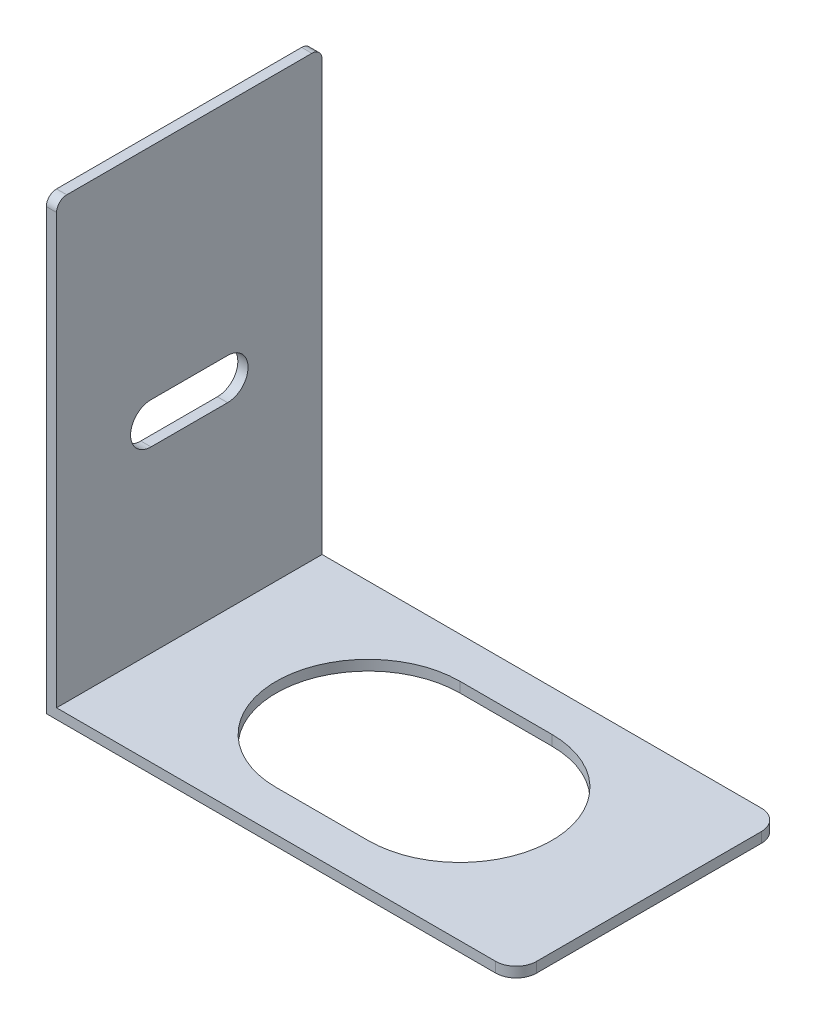
ISO-10303-21;
HEADER;
FILE_DESCRIPTION(('STEP AP214'),'2;1');
FILE_NAME('part.step','',(''),(''),'','','');
FILE_SCHEMA(('AUTOMOTIVE_DESIGN { 1 0 10303 214 1 1 1 1 }'));
ENDSEC;
DATA;
#1=APPLICATION_CONTEXT('core data for automotive mechanical design processes');
#2=APPLICATION_PROTOCOL_DEFINITION('international standard','automotive_design',2000,#1);
#3=PRODUCT_CONTEXT('',#1,'mechanical');
#4=PRODUCT('Part','Part','',(#3));
#5=PRODUCT_RELATED_PRODUCT_CATEGORY('part','',(#4));
#6=PRODUCT_DEFINITION_FORMATION('','',#4);
#7=PRODUCT_DEFINITION_CONTEXT('part definition',#1,'design');
#8=PRODUCT_DEFINITION('design','',#6,#7);
#9=PRODUCT_DEFINITION_SHAPE('','',#8);
#10=(LENGTH_UNIT() NAMED_UNIT(*) SI_UNIT(.MILLI.,.METRE.));
#11=(NAMED_UNIT(*) PLANE_ANGLE_UNIT() SI_UNIT($,.RADIAN.));
#12=(NAMED_UNIT(*) SI_UNIT($,.STERADIAN.) SOLID_ANGLE_UNIT());
#13=UNCERTAINTY_MEASURE_WITH_UNIT(LENGTH_MEASURE(1.E-05),#10,'distance_accuracy_value','');
#14=(GEOMETRIC_REPRESENTATION_CONTEXT(3) GLOBAL_UNCERTAINTY_ASSIGNED_CONTEXT((#13)) GLOBAL_UNIT_ASSIGNED_CONTEXT((#10,
#11,#12)) REPRESENTATION_CONTEXT('',''));
#15=CARTESIAN_POINT('',(0.,0.,0.));
#16=DIRECTION('',(0.,0.,1.));
#17=DIRECTION('',(1.,0.,0.));
#18=AXIS2_PLACEMENT_3D('',#15,#16,#17);
#19=CARTESIAN_POINT('',(21.,1.,11.));
#20=DIRECTION('',(0.,1.,0.));
#21=DIRECTION('',(0.,0.,1.));
#22=AXIS2_PLACEMENT_3D('',#19,#20,#21);
#23=PLANE('',#22);
#24=DIRECTION('',(0.,0.,-1.));
#25=VECTOR('',#24,1.);
#26=CARTESIAN_POINT('',(-22.,1.,13.));
#27=LINE('',#26,#25);
#28=CARTESIAN_POINT('',(-22.,1.,13.));
#29=VERTEX_POINT('',#28);
#30=CARTESIAN_POINT('',(-22.,1.,-13.));
#31=VERTEX_POINT('',#30);
#32=EDGE_CURVE('E214',#29,#31,#27,.T.);
#33=ORIENTED_EDGE('',*,*,#32,.F.);
#34=DIRECTION('',(1.,0.,0.));
#35=VECTOR('',#34,1.);
#36=CARTESIAN_POINT('',(-23.,1.,13.));
#37=LINE('',#36,#35);
#38=CARTESIAN_POINT('',(21.,1.,13.));
#39=VERTEX_POINT('',#38);
#40=EDGE_CURVE('E281',#29,#39,#37,.T.);
#41=ORIENTED_EDGE('',*,*,#40,.T.);
#42=CARTESIAN_POINT('',(21.,1.,11.));
#43=DIRECTION('',(0.,1.,0.));
#44=DIRECTION('',(0.,0.,1.));
#45=AXIS2_PLACEMENT_3D('',#42,#43,#44);
#46=CIRCLE('',#45,2.);
#47=CARTESIAN_POINT('',(23.,1.,11.));
#48=VERTEX_POINT('',#47);
#49=EDGE_CURVE('E284',#39,#48,#46,.T.);
#50=ORIENTED_EDGE('',*,*,#49,.T.);
#51=DIRECTION('',(0.,0.,-1.));
#52=VECTOR('',#51,1.);
#53=CARTESIAN_POINT('',(23.,1.,-11.));
#54=LINE('',#53,#52);
#55=CARTESIAN_POINT('',(23.,1.,-11.));
#56=VERTEX_POINT('',#55);
#57=EDGE_CURVE('E288',#48,#56,#54,.T.);
#58=ORIENTED_EDGE('',*,*,#57,.T.);
#59=CARTESIAN_POINT('',(21.,1.,-11.));
#60=DIRECTION('',(0.,1.,0.));
#61=DIRECTION('',(0.,0.,-1.));
#62=AXIS2_PLACEMENT_3D('',#59,#60,#61);
#63=CIRCLE('',#62,2.);
#64=CARTESIAN_POINT('',(21.,1.,-13.));
#65=VERTEX_POINT('',#64);
#66=EDGE_CURVE('E291',#56,#65,#63,.T.);
#67=ORIENTED_EDGE('',*,*,#66,.T.);
#68=DIRECTION('',(-1.,0.,0.));
#69=VECTOR('',#68,1.);
#70=CARTESIAN_POINT('',(-23.,1.,-13.));
#71=LINE('',#70,#69);
#72=EDGE_CURVE('E294',#65,#31,#71,.T.);
#73=ORIENTED_EDGE('',*,*,#72,.T.);
#74=EDGE_LOOP('',(#33,#41,#50,#58,#67,#73));
#75=FACE_BOUND('',#74,.T.);
#76=DIRECTION('',(1.,0.,0.));
#77=VECTOR('',#76,1.);
#78=CARTESIAN_POINT('',(-4.5,1.,9.));
#79=LINE('',#78,#77);
#80=CARTESIAN_POINT('',(-4.5,1.,9.));
#81=VERTEX_POINT('',#80);
#82=CARTESIAN_POINT('',(4.5,1.,9.));
#83=VERTEX_POINT('',#82);
#84=EDGE_CURVE('E241',#81,#83,#79,.T.);
#85=ORIENTED_EDGE('',*,*,#84,.F.);
#86=CARTESIAN_POINT('',(-4.5,1.,0.));
#87=DIRECTION('',(0.,1.,0.));
#88=DIRECTION('',(0.,0.,1.));
#89=AXIS2_PLACEMENT_3D('',#86,#87,#88);
#90=CIRCLE('',#89,9.);
#91=CARTESIAN_POINT('',(-4.5,1.,-9.));
#92=VERTEX_POINT('',#91);
#93=EDGE_CURVE('E238',#92,#81,#90,.T.);
#94=ORIENTED_EDGE('',*,*,#93,.F.);
#95=DIRECTION('',(-1.,0.,0.));
#96=VECTOR('',#95,1.);
#97=CARTESIAN_POINT('',(-4.5,1.,-9.));
#98=LINE('',#97,#96);
#99=CARTESIAN_POINT('',(4.49999999999999,1.,-9.));
#100=VERTEX_POINT('',#99);
#101=EDGE_CURVE('E249',#100,#92,#98,.T.);
#102=ORIENTED_EDGE('',*,*,#101,.F.);
#103=CARTESIAN_POINT('',(4.5,1.,0.));
#104=DIRECTION('',(0.,1.,0.));
#105=DIRECTION('',(0.,0.,1.));
#106=AXIS2_PLACEMENT_3D('',#103,#104,#105);
#107=CIRCLE('',#106,9.);
#108=EDGE_CURVE('E245',#83,#100,#107,.T.);
#109=ORIENTED_EDGE('',*,*,#108,.F.);
#110=EDGE_LOOP('',(#85,#94,#102,#109));
#111=FACE_BOUND('',#110,.T.);
#112=ADVANCED_FACE('F39',(#75,#111),#23,.T.);
#113=CARTESIAN_POINT('',(21.,0.,11.));
#114=DIRECTION('',(0.,1.,0.));
#115=DIRECTION('',(0.,0.,1.));
#116=AXIS2_PLACEMENT_3D('',#113,#114,#115);
#117=PLANE('',#116);
#118=DIRECTION('',(0.,0.,1.));
#119=VECTOR('',#118,1.);
#120=CARTESIAN_POINT('',(-23.,0.,-13.));
#121=LINE('',#120,#119);
#122=CARTESIAN_POINT('',(-23.,0.,-13.));
#123=VERTEX_POINT('',#122);
#124=CARTESIAN_POINT('',(-23.,0.,13.));
#125=VERTEX_POINT('',#124);
#126=EDGE_CURVE('E280',#123,#125,#121,.T.);
#127=ORIENTED_EDGE('',*,*,#126,.F.);
#128=DIRECTION('',(-1.,0.,0.));
#129=VECTOR('',#128,1.);
#130=CARTESIAN_POINT('',(-23.,0.,-13.));
#131=LINE('',#130,#129);
#132=CARTESIAN_POINT('',(21.,0.,-13.));
#133=VERTEX_POINT('',#132);
#134=EDGE_CURVE('E285',#133,#123,#131,.T.);
#135=ORIENTED_EDGE('',*,*,#134,.F.);
#136=CARTESIAN_POINT('',(21.,0.,-11.));
#137=DIRECTION('',(0.,1.,0.));
#138=DIRECTION('',(0.,0.,-1.));
#139=AXIS2_PLACEMENT_3D('',#136,#137,#138);
#140=CIRCLE('',#139,2.);
#141=CARTESIAN_POINT('',(23.,0.,-11.));
#142=VERTEX_POINT('',#141);
#143=EDGE_CURVE('E311',#142,#133,#140,.T.);
#144=ORIENTED_EDGE('',*,*,#143,.F.);
#145=DIRECTION('',(0.,0.,-1.));
#146=VECTOR('',#145,1.);
#147=CARTESIAN_POINT('',(23.,0.,-11.));
#148=LINE('',#147,#146);
#149=CARTESIAN_POINT('',(23.,0.,11.));
#150=VERTEX_POINT('',#149);
#151=EDGE_CURVE('E308',#150,#142,#148,.T.);
#152=ORIENTED_EDGE('',*,*,#151,.F.);
#153=CARTESIAN_POINT('',(21.,0.,11.));
#154=DIRECTION('',(0.,1.,0.));
#155=DIRECTION('',(0.,0.,1.));
#156=AXIS2_PLACEMENT_3D('',#153,#154,#155);
#157=CIRCLE('',#156,2.);
#158=CARTESIAN_POINT('',(21.,0.,13.));
#159=VERTEX_POINT('',#158);
#160=EDGE_CURVE('E305',#159,#150,#157,.T.);
#161=ORIENTED_EDGE('',*,*,#160,.F.);
#162=DIRECTION('',(1.,0.,0.));
#163=VECTOR('',#162,1.);
#164=CARTESIAN_POINT('',(-23.,0.,13.));
#165=LINE('',#164,#163);
#166=EDGE_CURVE('E302',#125,#159,#165,.T.);
#167=ORIENTED_EDGE('',*,*,#166,.F.);
#168=EDGE_LOOP('',(#127,#135,#144,#152,#161,#167));
#169=FACE_BOUND('',#168,.T.);
#170=CARTESIAN_POINT('',(-4.5,0.,0.));
#171=DIRECTION('',(0.,1.,0.));
#172=DIRECTION('',(0.,0.,1.));
#173=AXIS2_PLACEMENT_3D('',#170,#171,#172);
#174=CIRCLE('',#173,9.);
#175=CARTESIAN_POINT('',(-4.5,0.,-9.));
#176=VERTEX_POINT('',#175);
#177=CARTESIAN_POINT('',(-4.5,0.,9.));
#178=VERTEX_POINT('',#177);
#179=EDGE_CURVE('E237',#176,#178,#174,.T.);
#180=ORIENTED_EDGE('',*,*,#179,.T.);
#181=DIRECTION('',(1.,0.,0.));
#182=VECTOR('',#181,1.);
#183=CARTESIAN_POINT('',(-4.5,0.,9.));
#184=LINE('',#183,#182);
#185=CARTESIAN_POINT('',(4.5,0.,9.));
#186=VERTEX_POINT('',#185);
#187=EDGE_CURVE('E256',#178,#186,#184,.T.);
#188=ORIENTED_EDGE('',*,*,#187,.T.);
#189=CARTESIAN_POINT('',(4.5,0.,0.));
#190=DIRECTION('',(0.,1.,0.));
#191=DIRECTION('',(0.,0.,1.));
#192=AXIS2_PLACEMENT_3D('',#189,#190,#191);
#193=CIRCLE('',#192,9.);
#194=CARTESIAN_POINT('',(4.5,0.,-9.));
#195=VERTEX_POINT('',#194);
#196=EDGE_CURVE('E260',#186,#195,#193,.T.);
#197=ORIENTED_EDGE('',*,*,#196,.T.);
#198=DIRECTION('',(-1.,0.,0.));
#199=VECTOR('',#198,1.);
#200=CARTESIAN_POINT('',(-4.5,0.,-9.));
#201=LINE('',#200,#199);
#202=EDGE_CURVE('E242',#195,#176,#201,.T.);
#203=ORIENTED_EDGE('',*,*,#202,.T.);
#204=EDGE_LOOP('',(#180,#188,#197,#203));
#205=FACE_BOUND('',#204,.T.);
#206=ADVANCED_FACE('F385',(#169,#205),#117,.F.);
#207=CARTESIAN_POINT('',(-23.,1.,-13.));
#208=DIRECTION('',(1.,0.,0.));
#209=DIRECTION('',(0.,0.,-1.));
#210=AXIS2_PLACEMENT_3D('',#207,#208,#209);
#211=PLANE('',#210);
#212=DIRECTION('',(0.,0.,1.));
#213=VECTOR('',#212,1.);
#214=CARTESIAN_POINT('',(-23.,22.5,3.75));
#215=LINE('',#214,#213);
#216=CARTESIAN_POINT('',(-23.,22.5,-3.75));
#217=VERTEX_POINT('',#216);
#218=CARTESIAN_POINT('',(-23.,22.5,3.75));
#219=VERTEX_POINT('',#218);
#220=EDGE_CURVE('E178',#217,#219,#215,.T.);
#221=ORIENTED_EDGE('',*,*,#220,.T.);
#222=CARTESIAN_POINT('',(-23.,20.5,3.75));
#223=DIRECTION('',(1.,0.,0.));
#224=DIRECTION('',(0.,0.,-1.));
#225=AXIS2_PLACEMENT_3D('',#222,#223,#224);
#226=CIRCLE('',#225,2.);
#227=CARTESIAN_POINT('',(-23.,18.5,3.75));
#228=VERTEX_POINT('',#227);
#229=EDGE_CURVE('E169',#219,#228,#226,.T.);
#230=ORIENTED_EDGE('',*,*,#229,.T.);
#231=DIRECTION('',(0.,0.,-1.));
#232=VECTOR('',#231,1.);
#233=CARTESIAN_POINT('',(-23.,18.5,3.75));
#234=LINE('',#233,#232);
#235=CARTESIAN_POINT('',(-23.,18.5,-3.75));
#236=VERTEX_POINT('',#235);
#237=EDGE_CURVE('E182',#228,#236,#234,.T.);
#238=ORIENTED_EDGE('',*,*,#237,.T.);
#239=CARTESIAN_POINT('',(-23.,20.5,-3.75));
#240=DIRECTION('',(1.,0.,0.));
#241=DIRECTION('',(0.,0.,-1.));
#242=AXIS2_PLACEMENT_3D('',#239,#240,#241);
#243=CIRCLE('',#242,2.);
#244=EDGE_CURVE('E187',#236,#217,#243,.T.);
#245=ORIENTED_EDGE('',*,*,#244,.T.);
#246=EDGE_LOOP('',(#221,#230,#238,#245));
#247=FACE_BOUND('',#246,.T.);
#248=DIRECTION('',(0.,-1.,0.));
#249=VECTOR('',#248,1.);
#250=CARTESIAN_POINT('',(-23.,1.,13.));
#251=LINE('',#250,#249);
#252=CARTESIAN_POINT('',(-23.,43.,13.));
#253=VERTEX_POINT('',#252);
#254=EDGE_CURVE('E335',#253,#125,#251,.T.);
#255=ORIENTED_EDGE('',*,*,#254,.F.);
#256=CARTESIAN_POINT('',(-23.,43.,12.));
#257=DIRECTION('',(1.,0.,0.));
#258=DIRECTION('',(0.,0.,-1.));
#259=AXIS2_PLACEMENT_3D('',#256,#257,#258);
#260=CIRCLE('',#259,1.);
#261=CARTESIAN_POINT('',(-23.,44.,12.));
#262=VERTEX_POINT('',#261);
#263=EDGE_CURVE('E48',#253,#262,#260,.F.);
#264=ORIENTED_EDGE('',*,*,#263,.T.);
#265=DIRECTION('',(0.,0.,1.));
#266=VECTOR('',#265,1.);
#267=CARTESIAN_POINT('',(-23.,44.,-13.));
#268=LINE('',#267,#266);
#269=CARTESIAN_POINT('',(-23.,44.,-12.));
#270=VERTEX_POINT('',#269);
#271=EDGE_CURVE('E220',#270,#262,#268,.T.);
#272=ORIENTED_EDGE('',*,*,#271,.F.);
#273=CARTESIAN_POINT('',(-23.,43.,-12.));
#274=DIRECTION('',(1.,0.,0.));
#275=DIRECTION('',(0.,0.,-1.));
#276=AXIS2_PLACEMENT_3D('',#273,#274,#275);
#277=CIRCLE('',#276,1.);
#278=CARTESIAN_POINT('',(-23.,43.,-13.));
#279=VERTEX_POINT('',#278);
#280=EDGE_CURVE('E55',#270,#279,#277,.F.);
#281=ORIENTED_EDGE('',*,*,#280,.T.);
#282=DIRECTION('',(0.,-1.,0.));
#283=VECTOR('',#282,1.);
#284=CARTESIAN_POINT('',(-23.,1.,-13.));
#285=LINE('',#284,#283);
#286=EDGE_CURVE('E298',#279,#123,#285,.T.);
#287=ORIENTED_EDGE('',*,*,#286,.T.);
#288=ORIENTED_EDGE('',*,*,#126,.T.);
#289=EDGE_LOOP('',(#255,#264,#272,#281,#287,#288));
#290=FACE_BOUND('',#289,.T.);
#291=ADVANCED_FACE('F189',(#247,#290),#211,.F.);
#292=CARTESIAN_POINT('',(-23.,1.,13.));
#293=DIRECTION('',(0.,0.,-1.));
#294=DIRECTION('',(-1.,0.,0.));
#295=AXIS2_PLACEMENT_3D('',#292,#293,#294);
#296=PLANE('',#295);
#297=DIRECTION('',(0.,-1.,0.));
#298=VECTOR('',#297,1.);
#299=CARTESIAN_POINT('',(-22.,44.,13.));
#300=LINE('',#299,#298);
#301=CARTESIAN_POINT('',(-22.,43.,13.));
#302=VERTEX_POINT('',#301);
#303=EDGE_CURVE('E234',#302,#29,#300,.T.);
#304=ORIENTED_EDGE('',*,*,#303,.F.);
#305=DIRECTION('',(1.,0.,0.));
#306=VECTOR('',#305,1.);
#307=CARTESIAN_POINT('',(-23.,43.,13.));
#308=LINE('',#307,#306);
#309=EDGE_CURVE('E63',#302,#253,#308,.F.);
#310=ORIENTED_EDGE('',*,*,#309,.T.);
#311=ORIENTED_EDGE('',*,*,#254,.T.);
#312=ORIENTED_EDGE('',*,*,#166,.T.);
#313=DIRECTION('',(0.,-1.,0.));
#314=VECTOR('',#313,1.);
#315=CARTESIAN_POINT('',(21.,1.,13.));
#316=LINE('',#315,#314);
#317=EDGE_CURVE('E331',#39,#159,#316,.T.);
#318=ORIENTED_EDGE('',*,*,#317,.F.);
#319=ORIENTED_EDGE('',*,*,#40,.F.);
#320=EDGE_LOOP('',(#304,#310,#311,#312,#318,#319));
#321=FACE_BOUND('',#320,.T.);
#322=ADVANCED_FACE('F368',(#321),#296,.F.);
#323=CARTESIAN_POINT('',(21.,1.,11.));
#324=DIRECTION('',(0.,-1.,0.));
#325=DIRECTION('',(0.,0.,-1.));
#326=AXIS2_PLACEMENT_3D('',#323,#324,#325);
#327=CYLINDRICAL_SURFACE('',#326,2.);
#328=ORIENTED_EDGE('',*,*,#160,.T.);
#329=DIRECTION('',(0.,-1.,0.));
#330=VECTOR('',#329,1.);
#331=CARTESIAN_POINT('',(23.,1.,11.));
#332=LINE('',#331,#330);
#333=EDGE_CURVE('E327',#48,#150,#332,.T.);
#334=ORIENTED_EDGE('',*,*,#333,.F.);
#335=ORIENTED_EDGE('',*,*,#49,.F.);
#336=ORIENTED_EDGE('',*,*,#317,.T.);
#337=EDGE_LOOP('',(#328,#334,#335,#336));
#338=FACE_BOUND('',#337,.T.);
#339=ADVANCED_FACE('F391',(#338),#327,.T.);
#340=CARTESIAN_POINT('',(23.,1.,-11.));
#341=DIRECTION('',(-1.,0.,0.));
#342=DIRECTION('',(0.,0.,1.));
#343=AXIS2_PLACEMENT_3D('',#340,#341,#342);
#344=PLANE('',#343);
#345=ORIENTED_EDGE('',*,*,#151,.T.);
#346=DIRECTION('',(0.,-1.,0.));
#347=VECTOR('',#346,1.);
#348=CARTESIAN_POINT('',(23.,1.,-11.));
#349=LINE('',#348,#347);
#350=EDGE_CURVE('E323',#56,#142,#349,.T.);
#351=ORIENTED_EDGE('',*,*,#350,.F.);
#352=ORIENTED_EDGE('',*,*,#57,.F.);
#353=ORIENTED_EDGE('',*,*,#333,.T.);
#354=EDGE_LOOP('',(#345,#351,#352,#353));
#355=FACE_BOUND('',#354,.T.);
#356=ADVANCED_FACE('F395',(#355),#344,.F.);
#357=CARTESIAN_POINT('',(21.,1.,-11.));
#358=DIRECTION('',(0.,-1.,0.));
#359=DIRECTION('',(0.,0.,-1.));
#360=AXIS2_PLACEMENT_3D('',#357,#358,#359);
#361=CYLINDRICAL_SURFACE('',#360,2.);
#362=ORIENTED_EDGE('',*,*,#143,.T.);
#363=DIRECTION('',(0.,-1.,0.));
#364=VECTOR('',#363,1.);
#365=CARTESIAN_POINT('',(21.,1.,-13.));
#366=LINE('',#365,#364);
#367=EDGE_CURVE('E319',#65,#133,#366,.T.);
#368=ORIENTED_EDGE('',*,*,#367,.F.);
#369=ORIENTED_EDGE('',*,*,#66,.F.);
#370=ORIENTED_EDGE('',*,*,#350,.T.);
#371=EDGE_LOOP('',(#362,#368,#369,#370));
#372=FACE_BOUND('',#371,.T.);
#373=ADVANCED_FACE('F399',(#372),#361,.T.);
#374=CARTESIAN_POINT('',(-23.,1.,-13.));
#375=DIRECTION('',(0.,0.,1.));
#376=DIRECTION('',(1.,0.,0.));
#377=AXIS2_PLACEMENT_3D('',#374,#375,#376);
#378=PLANE('',#377);
#379=ORIENTED_EDGE('',*,*,#286,.F.);
#380=DIRECTION('',(-1.,0.,0.));
#381=VECTOR('',#380,1.);
#382=CARTESIAN_POINT('',(-22.,43.,-13.));
#383=LINE('',#382,#381);
#384=CARTESIAN_POINT('',(-22.,43.,-13.));
#385=VERTEX_POINT('',#384);
#386=EDGE_CURVE('E11',#279,#385,#383,.F.);
#387=ORIENTED_EDGE('',*,*,#386,.T.);
#388=DIRECTION('',(0.,-1.,0.));
#389=VECTOR('',#388,1.);
#390=CARTESIAN_POINT('',(-22.,44.,-13.));
#391=LINE('',#390,#389);
#392=EDGE_CURVE('E228',#385,#31,#391,.T.);
#393=ORIENTED_EDGE('',*,*,#392,.T.);
#394=ORIENTED_EDGE('',*,*,#72,.F.);
#395=ORIENTED_EDGE('',*,*,#367,.T.);
#396=ORIENTED_EDGE('',*,*,#134,.T.);
#397=EDGE_LOOP('',(#379,#387,#393,#394,#395,#396));
#398=FACE_BOUND('',#397,.T.);
#399=ADVANCED_FACE('F380',(#398),#378,.F.);
#400=CARTESIAN_POINT('',(-4.5,1.,0.));
#401=DIRECTION('',(0.,-1.,0.));
#402=DIRECTION('',(0.,0.,-1.));
#403=AXIS2_PLACEMENT_3D('',#400,#401,#402);
#404=CYLINDRICAL_SURFACE('',#403,9.);
#405=ORIENTED_EDGE('',*,*,#179,.F.);
#406=DIRECTION('',(0.,-1.,0.));
#407=VECTOR('',#406,1.);
#408=CARTESIAN_POINT('',(-4.5,1.,-9.));
#409=LINE('',#408,#407);
#410=EDGE_CURVE('E252',#92,#176,#409,.T.);
#411=ORIENTED_EDGE('',*,*,#410,.F.);
#412=ORIENTED_EDGE('',*,*,#93,.T.);
#413=DIRECTION('',(0.,-1.,0.));
#414=VECTOR('',#413,1.);
#415=CARTESIAN_POINT('',(-4.5,1.,9.));
#416=LINE('',#415,#414);
#417=EDGE_CURVE('E276',#81,#178,#416,.T.);
#418=ORIENTED_EDGE('',*,*,#417,.T.);
#419=EDGE_LOOP('',(#405,#411,#412,#418));
#420=FACE_BOUND('',#419,.T.);
#421=ADVANCED_FACE('F406',(#420),#404,.F.);
#422=CARTESIAN_POINT('',(-4.5,1.,9.));
#423=DIRECTION('',(0.,0.,-1.));
#424=DIRECTION('',(-1.,0.,0.));
#425=AXIS2_PLACEMENT_3D('',#422,#423,#424);
#426=PLANE('',#425);
#427=ORIENTED_EDGE('',*,*,#187,.F.);
#428=ORIENTED_EDGE('',*,*,#417,.F.);
#429=ORIENTED_EDGE('',*,*,#84,.T.);
#430=DIRECTION('',(0.,-1.,0.));
#431=VECTOR('',#430,1.);
#432=CARTESIAN_POINT('',(4.5,1.,9.));
#433=LINE('',#432,#431);
#434=EDGE_CURVE('E273',#83,#186,#433,.T.);
#435=ORIENTED_EDGE('',*,*,#434,.T.);
#436=EDGE_LOOP('',(#427,#428,#429,#435));
#437=FACE_BOUND('',#436,.T.);
#438=ADVANCED_FACE('F418',(#437),#426,.T.);
#439=CARTESIAN_POINT('',(4.5,1.,0.));
#440=DIRECTION('',(0.,-1.,0.));
#441=DIRECTION('',(0.,0.,-1.));
#442=AXIS2_PLACEMENT_3D('',#439,#440,#441);
#443=CYLINDRICAL_SURFACE('',#442,9.);
#444=ORIENTED_EDGE('',*,*,#196,.F.);
#445=ORIENTED_EDGE('',*,*,#434,.F.);
#446=ORIENTED_EDGE('',*,*,#108,.T.);
#447=DIRECTION('',(0.,-1.,0.));
#448=VECTOR('',#447,1.);
#449=CARTESIAN_POINT('',(4.5,1.,-9.));
#450=LINE('',#449,#448);
#451=EDGE_CURVE('E270',#100,#195,#450,.T.);
#452=ORIENTED_EDGE('',*,*,#451,.T.);
#453=EDGE_LOOP('',(#444,#445,#446,#452));
#454=FACE_BOUND('',#453,.T.);
#455=ADVANCED_FACE('F422',(#454),#443,.F.);
#456=CARTESIAN_POINT('',(-4.5,1.,-9.));
#457=DIRECTION('',(0.,0.,1.));
#458=DIRECTION('',(1.,0.,0.));
#459=AXIS2_PLACEMENT_3D('',#456,#457,#458);
#460=PLANE('',#459);
#461=ORIENTED_EDGE('',*,*,#202,.F.);
#462=ORIENTED_EDGE('',*,*,#451,.F.);
#463=ORIENTED_EDGE('',*,*,#101,.T.);
#464=ORIENTED_EDGE('',*,*,#410,.T.);
#465=EDGE_LOOP('',(#461,#462,#463,#464));
#466=FACE_BOUND('',#465,.T.);
#467=ADVANCED_FACE('F426',(#466),#460,.T.);
#468=CARTESIAN_POINT('',(-22.,44.,13.));
#469=DIRECTION('',(-1.,0.,0.));
#470=DIRECTION('',(0.,0.,1.));
#471=AXIS2_PLACEMENT_3D('',#468,#469,#470);
#472=PLANE('',#471);
#473=DIRECTION('',(0.,0.,-1.));
#474=VECTOR('',#473,1.);
#475=CARTESIAN_POINT('',(-22.,18.5,3.75));
#476=LINE('',#475,#474);
#477=CARTESIAN_POINT('',(-22.,18.5,3.75));
#478=VERTEX_POINT('',#477);
#479=CARTESIAN_POINT('',(-22.,18.5,-3.75));
#480=VERTEX_POINT('',#479);
#481=EDGE_CURVE('E205',#478,#480,#476,.T.);
#482=ORIENTED_EDGE('',*,*,#481,.F.);
#483=CARTESIAN_POINT('',(-22.,20.5,3.75));
#484=DIRECTION('',(1.,0.,0.));
#485=DIRECTION('',(0.,0.,-1.));
#486=AXIS2_PLACEMENT_3D('',#483,#484,#485);
#487=CIRCLE('',#486,2.);
#488=CARTESIAN_POINT('',(-22.,22.5,3.75));
#489=VERTEX_POINT('',#488);
#490=EDGE_CURVE('E172',#489,#478,#487,.T.);
#491=ORIENTED_EDGE('',*,*,#490,.F.);
#492=DIRECTION('',(0.,0.,1.));
#493=VECTOR('',#492,1.);
#494=CARTESIAN_POINT('',(-22.,22.5,3.75));
#495=LINE('',#494,#493);
#496=CARTESIAN_POINT('',(-22.,22.5,-3.75));
#497=VERTEX_POINT('',#496);
#498=EDGE_CURVE('E192',#497,#489,#495,.T.);
#499=ORIENTED_EDGE('',*,*,#498,.F.);
#500=CARTESIAN_POINT('',(-22.,20.5,-3.75));
#501=DIRECTION('',(1.,0.,0.));
#502=DIRECTION('',(0.,0.,-1.));
#503=AXIS2_PLACEMENT_3D('',#500,#501,#502);
#504=CIRCLE('',#503,2.);
#505=EDGE_CURVE('E196',#480,#497,#504,.T.);
#506=ORIENTED_EDGE('',*,*,#505,.F.);
#507=EDGE_LOOP('',(#482,#491,#499,#506));
#508=FACE_BOUND('',#507,.T.);
#509=DIRECTION('',(0.,0.,-1.));
#510=VECTOR('',#509,1.);
#511=CARTESIAN_POINT('',(-22.,44.,13.));
#512=LINE('',#511,#510);
#513=CARTESIAN_POINT('',(-22.,44.,12.));
#514=VERTEX_POINT('',#513);
#515=CARTESIAN_POINT('',(-22.,44.,-12.));
#516=VERTEX_POINT('',#515);
#517=EDGE_CURVE('E224',#514,#516,#512,.T.);
#518=ORIENTED_EDGE('',*,*,#517,.F.);
#519=CARTESIAN_POINT('',(-22.,43.,12.));
#520=DIRECTION('',(-1.,0.,0.));
#521=DIRECTION('',(0.,0.,1.));
#522=AXIS2_PLACEMENT_3D('',#519,#520,#521);
#523=CIRCLE('',#522,1.);
#524=EDGE_CURVE('E349',#514,#302,#523,.F.);
#525=ORIENTED_EDGE('',*,*,#524,.T.);
#526=ORIENTED_EDGE('',*,*,#303,.T.);
#527=ORIENTED_EDGE('',*,*,#32,.T.);
#528=ORIENTED_EDGE('',*,*,#392,.F.);
#529=CARTESIAN_POINT('',(-22.,43.,-12.));
#530=DIRECTION('',(-1.,0.,0.));
#531=DIRECTION('',(0.,0.,1.));
#532=AXIS2_PLACEMENT_3D('',#529,#530,#531);
#533=CIRCLE('',#532,1.);
#534=EDGE_CURVE('E346',#385,#516,#533,.F.);
#535=ORIENTED_EDGE('',*,*,#534,.T.);
#536=EDGE_LOOP('',(#518,#525,#526,#527,#528,#535));
#537=FACE_BOUND('',#536,.T.);
#538=ADVANCED_FACE('F365',(#508,#537),#472,.F.);
#539=CARTESIAN_POINT('',(0.,44.,0.));
#540=DIRECTION('',(0.,1.,0.));
#541=DIRECTION('',(0.,0.,1.));
#542=AXIS2_PLACEMENT_3D('',#539,#540,#541);
#543=PLANE('',#542);
#544=ORIENTED_EDGE('',*,*,#271,.T.);
#545=DIRECTION('',(1.,0.,0.));
#546=VECTOR('',#545,1.);
#547=CARTESIAN_POINT('',(-22.,44.,12.));
#548=LINE('',#547,#546);
#549=EDGE_CURVE('E342',#262,#514,#548,.T.);
#550=ORIENTED_EDGE('',*,*,#549,.T.);
#551=ORIENTED_EDGE('',*,*,#517,.T.);
#552=DIRECTION('',(-1.,0.,0.));
#553=VECTOR('',#552,1.);
#554=CARTESIAN_POINT('',(-23.,44.,-12.));
#555=LINE('',#554,#553);
#556=EDGE_CURVE('E338',#516,#270,#555,.T.);
#557=ORIENTED_EDGE('',*,*,#556,.T.);
#558=EDGE_LOOP('',(#544,#550,#551,#557));
#559=FACE_BOUND('',#558,.T.);
#560=ADVANCED_FACE('F360',(#559),#543,.T.);
#561=CARTESIAN_POINT('',(-23.,20.5,3.75));
#562=DIRECTION('',(1.,0.,0.));
#563=DIRECTION('',(0.,0.,-1.));
#564=AXIS2_PLACEMENT_3D('',#561,#562,#563);
#565=CYLINDRICAL_SURFACE('',#564,2.);
#566=ORIENTED_EDGE('',*,*,#490,.T.);
#567=DIRECTION('',(1.,0.,0.));
#568=VECTOR('',#567,1.);
#569=CARTESIAN_POINT('',(-23.,18.5,3.75));
#570=LINE('',#569,#568);
#571=EDGE_CURVE('E165',#228,#478,#570,.T.);
#572=ORIENTED_EDGE('',*,*,#571,.F.);
#573=ORIENTED_EDGE('',*,*,#229,.F.);
#574=DIRECTION('',(1.,0.,0.));
#575=VECTOR('',#574,1.);
#576=CARTESIAN_POINT('',(-23.,22.5,3.75));
#577=LINE('',#576,#575);
#578=EDGE_CURVE('E211',#219,#489,#577,.T.);
#579=ORIENTED_EDGE('',*,*,#578,.T.);
#580=EDGE_LOOP('',(#566,#572,#573,#579));
#581=FACE_BOUND('',#580,.T.);
#582=ADVANCED_FACE('F167',(#581),#565,.F.);
#583=CARTESIAN_POINT('',(-23.,22.5,3.75));
#584=DIRECTION('',(0.,1.,0.));
#585=DIRECTION('',(0.,0.,1.));
#586=AXIS2_PLACEMENT_3D('',#583,#584,#585);
#587=PLANE('',#586);
#588=ORIENTED_EDGE('',*,*,#498,.T.);
#589=ORIENTED_EDGE('',*,*,#578,.F.);
#590=ORIENTED_EDGE('',*,*,#220,.F.);
#591=DIRECTION('',(1.,0.,0.));
#592=VECTOR('',#591,1.);
#593=CARTESIAN_POINT('',(-23.,22.5,-3.75));
#594=LINE('',#593,#592);
#595=EDGE_CURVE('E215',#217,#497,#594,.T.);
#596=ORIENTED_EDGE('',*,*,#595,.T.);
#597=EDGE_LOOP('',(#588,#589,#590,#596));
#598=FACE_BOUND('',#597,.T.);
#599=ADVANCED_FACE('F438',(#598),#587,.F.);
#600=CARTESIAN_POINT('',(-23.,20.5,-3.75));
#601=DIRECTION('',(1.,0.,0.));
#602=DIRECTION('',(0.,0.,-1.));
#603=AXIS2_PLACEMENT_3D('',#600,#601,#602);
#604=CYLINDRICAL_SURFACE('',#603,2.);
#605=ORIENTED_EDGE('',*,*,#505,.T.);
#606=ORIENTED_EDGE('',*,*,#595,.F.);
#607=ORIENTED_EDGE('',*,*,#244,.F.);
#608=DIRECTION('',(1.,0.,0.));
#609=VECTOR('',#608,1.);
#610=CARTESIAN_POINT('',(-23.,18.5,-3.75));
#611=LINE('',#610,#609);
#612=EDGE_CURVE('E177',#236,#480,#611,.T.);
#613=ORIENTED_EDGE('',*,*,#612,.T.);
#614=EDGE_LOOP('',(#605,#606,#607,#613));
#615=FACE_BOUND('',#614,.T.);
#616=ADVANCED_FACE('F441',(#615),#604,.F.);
#617=CARTESIAN_POINT('',(-23.,18.5,3.75));
#618=DIRECTION('',(0.,-1.,0.));
#619=DIRECTION('',(0.,0.,-1.));
#620=AXIS2_PLACEMENT_3D('',#617,#618,#619);
#621=PLANE('',#620);
#622=ORIENTED_EDGE('',*,*,#481,.T.);
#623=ORIENTED_EDGE('',*,*,#612,.F.);
#624=ORIENTED_EDGE('',*,*,#237,.F.);
#625=ORIENTED_EDGE('',*,*,#571,.T.);
#626=EDGE_LOOP('',(#622,#623,#624,#625));
#627=FACE_BOUND('',#626,.T.);
#628=ADVANCED_FACE('F183',(#627),#621,.F.);
#629=CARTESIAN_POINT('',(0.,43.,12.));
#630=DIRECTION('',(-1.,0.,0.));
#631=DIRECTION('',(0.,0.,1.));
#632=AXIS2_PLACEMENT_3D('',#629,#630,#631);
#633=CYLINDRICAL_SURFACE('',#632,1.);
#634=ORIENTED_EDGE('',*,*,#263,.F.);
#635=ORIENTED_EDGE('',*,*,#309,.F.);
#636=ORIENTED_EDGE('',*,*,#524,.F.);
#637=ORIENTED_EDGE('',*,*,#549,.F.);
#638=EDGE_LOOP('',(#634,#635,#636,#637));
#639=FACE_BOUND('',#638,.T.);
#640=ADVANCED_FACE('F363',(#639),#633,.T.);
#641=CARTESIAN_POINT('',(0.,43.,-12.));
#642=DIRECTION('',(1.,0.,0.));
#643=DIRECTION('',(0.,0.,-1.));
#644=AXIS2_PLACEMENT_3D('',#641,#642,#643);
#645=CYLINDRICAL_SURFACE('',#644,1.);
#646=ORIENTED_EDGE('',*,*,#534,.F.);
#647=ORIENTED_EDGE('',*,*,#386,.F.);
#648=ORIENTED_EDGE('',*,*,#280,.F.);
#649=ORIENTED_EDGE('',*,*,#556,.F.);
#650=EDGE_LOOP('',(#646,#647,#648,#649));
#651=FACE_BOUND('',#650,.T.);
#652=ADVANCED_FACE('F41',(#651),#645,.T.);
#653=CLOSED_SHELL('',(#112,#206,#291,#322,#339,#356,#373,#399,#421,#438,#455,#467,#538,#560,
#582,#599,#616,#628,#640,#652));
#654=MANIFOLD_SOLID_BREP('B2',#653);
#655=ADVANCED_BREP_SHAPE_REPRESENTATION('',(#18,#654),#14);
#656=SHAPE_DEFINITION_REPRESENTATION(#9,#655);
ENDSEC;
END-ISO-10303-21;
